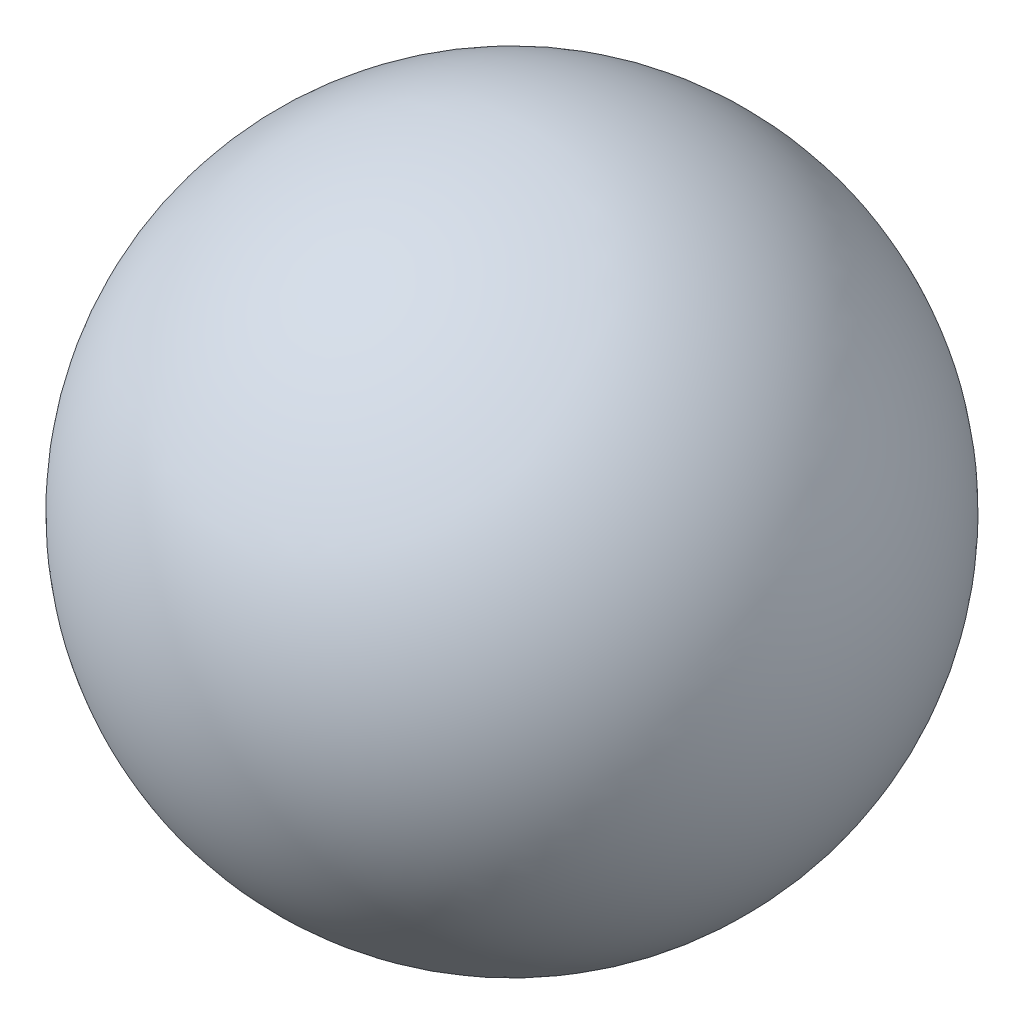
ISO-10303-21;
HEADER;
FILE_DESCRIPTION(('STEP AP214'),'2;1');
FILE_NAME('part.step','',(''),(''),'','','');
FILE_SCHEMA(('AUTOMOTIVE_DESIGN { 1 0 10303 214 1 1 1 1 }'));
ENDSEC;
DATA;
#1=APPLICATION_CONTEXT('core data for automotive mechanical design processes');
#2=APPLICATION_PROTOCOL_DEFINITION('international standard','automotive_design',2000,#1);
#3=PRODUCT_CONTEXT('',#1,'mechanical');
#4=PRODUCT('Part','Part','',(#3));
#5=PRODUCT_RELATED_PRODUCT_CATEGORY('part','',(#4));
#6=PRODUCT_DEFINITION_FORMATION('','',#4);
#7=PRODUCT_DEFINITION_CONTEXT('part definition',#1,'design');
#8=PRODUCT_DEFINITION('design','',#6,#7);
#9=PRODUCT_DEFINITION_SHAPE('','',#8);
#10=(LENGTH_UNIT() NAMED_UNIT(*) SI_UNIT(.MILLI.,.METRE.));
#11=(NAMED_UNIT(*) PLANE_ANGLE_UNIT() SI_UNIT($,.RADIAN.));
#12=(NAMED_UNIT(*) SI_UNIT($,.STERADIAN.) SOLID_ANGLE_UNIT());
#13=UNCERTAINTY_MEASURE_WITH_UNIT(LENGTH_MEASURE(1.E-05),#10,'distance_accuracy_value','');
#14=(GEOMETRIC_REPRESENTATION_CONTEXT(3) GLOBAL_UNCERTAINTY_ASSIGNED_CONTEXT((#13)) GLOBAL_UNIT_ASSIGNED_CONTEXT((#10,
#11,#12)) REPRESENTATION_CONTEXT('',''));
#15=CARTESIAN_POINT('',(0.,0.,0.));
#16=DIRECTION('',(0.,0.,1.));
#17=DIRECTION('',(1.,0.,0.));
#18=AXIS2_PLACEMENT_3D('',#15,#16,#17);
#19=CARTESIAN_POINT('',(0.,0.,0.));
#20=DIRECTION('',(0.,0.,-1.));
#21=DIRECTION('',(1.,0.,0.));
#22=AXIS2_PLACEMENT_3D('',#19,#20,#21);
#23=SPHERICAL_SURFACE('',#22,15.);
#24=CARTESIAN_POINT('',(0.,0.,-15.));
#25=VERTEX_POINT('',#24);
#26=VERTEX_LOOP('',#25);
#27=FACE_BOUND('',#26,.T.);
#28=ADVANCED_FACE('F31',(#27),#23,.T.);
#29=CLOSED_SHELL('',(#28));
#30=MANIFOLD_SOLID_BREP('B2',#29);
#31=ADVANCED_BREP_SHAPE_REPRESENTATION('',(#18,#30),#14);
#32=SHAPE_DEFINITION_REPRESENTATION(#9,#31);
ENDSEC;
END-ISO-10303-21;
